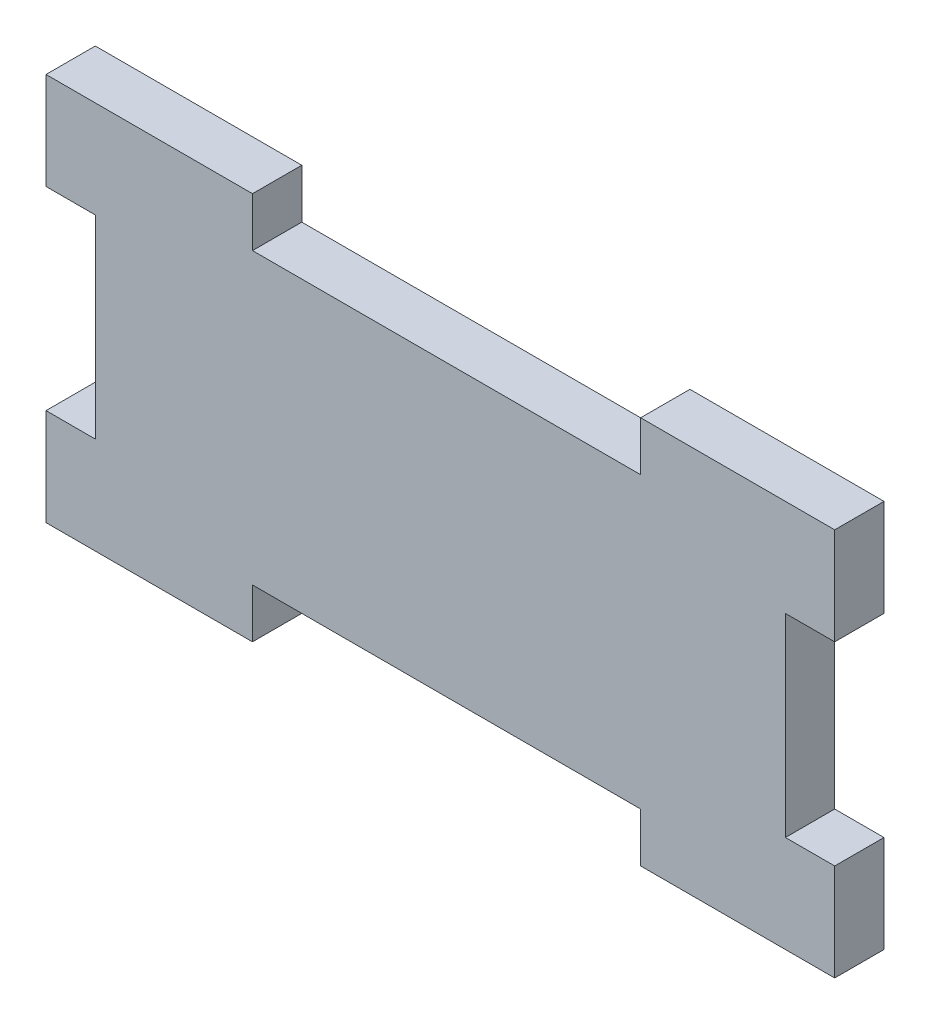
ISO-10303-21;
HEADER;
FILE_DESCRIPTION(('STEP AP214'),'2;1');
FILE_NAME('part.step','',(''),(''),'','','');
FILE_SCHEMA(('AUTOMOTIVE_DESIGN { 1 0 10303 214 1 1 1 1 }'));
ENDSEC;
DATA;
#1=APPLICATION_CONTEXT('core data for automotive mechanical design processes');
#2=APPLICATION_PROTOCOL_DEFINITION('international standard','automotive_design',2000,#1);
#3=PRODUCT_CONTEXT('',#1,'mechanical');
#4=PRODUCT('Part','Part','',(#3));
#5=PRODUCT_RELATED_PRODUCT_CATEGORY('part','',(#4));
#6=PRODUCT_DEFINITION_FORMATION('','',#4);
#7=PRODUCT_DEFINITION_CONTEXT('part definition',#1,'design');
#8=PRODUCT_DEFINITION('design','',#6,#7);
#9=PRODUCT_DEFINITION_SHAPE('','',#8);
#10=(LENGTH_UNIT() NAMED_UNIT(*) SI_UNIT(.MILLI.,.METRE.));
#11=(NAMED_UNIT(*) PLANE_ANGLE_UNIT() SI_UNIT($,.RADIAN.));
#12=(NAMED_UNIT(*) SI_UNIT($,.STERADIAN.) SOLID_ANGLE_UNIT());
#13=UNCERTAINTY_MEASURE_WITH_UNIT(LENGTH_MEASURE(1.E-05),#10,'distance_accuracy_value','');
#14=(GEOMETRIC_REPRESENTATION_CONTEXT(3) GLOBAL_UNCERTAINTY_ASSIGNED_CONTEXT((#13)) GLOBAL_UNIT_ASSIGNED_CONTEXT((#10,
#11,#12)) REPRESENTATION_CONTEXT('',''));
#15=CARTESIAN_POINT('',(0.,0.,0.));
#16=DIRECTION('',(0.,0.,1.));
#17=DIRECTION('',(1.,0.,0.));
#18=AXIS2_PLACEMENT_3D('',#15,#16,#17);
#19=CARTESIAN_POINT('',(0.,0.,6.35));
#20=DIRECTION('',(0.,1.,0.));
#21=DIRECTION('',(0.,0.,1.));
#22=AXIS2_PLACEMENT_3D('',#19,#20,#21);
#23=PLANE('',#22);
#24=DIRECTION('',(1.,0.,0.));
#25=VECTOR('',#24,1.);
#26=CARTESIAN_POINT('',(0.,0.,0.));
#27=LINE('',#26,#25);
#28=CARTESIAN_POINT('',(0.,0.,0.));
#29=VERTEX_POINT('',#28);
#30=CARTESIAN_POINT('',(26.6,0.,0.));
#31=VERTEX_POINT('',#30);
#32=EDGE_CURVE('E205',#29,#31,#27,.T.);
#33=ORIENTED_EDGE('',*,*,#32,.T.);
#34=DIRECTION('',(0.,0.,1.));
#35=VECTOR('',#34,1.);
#36=CARTESIAN_POINT('',(26.6,0.,0.));
#37=LINE('',#36,#35);
#38=CARTESIAN_POINT('',(26.6,0.,6.35));
#39=VERTEX_POINT('',#38);
#40=EDGE_CURVE('E312',#31,#39,#37,.T.);
#41=ORIENTED_EDGE('',*,*,#40,.T.);
#42=DIRECTION('',(1.,0.,0.));
#43=VECTOR('',#42,1.);
#44=CARTESIAN_POINT('',(0.,0.,6.35));
#45=LINE('',#44,#43);
#46=CARTESIAN_POINT('',(0.,0.,6.35));
#47=VERTEX_POINT('',#46);
#48=EDGE_CURVE('E375',#47,#39,#45,.T.);
#49=ORIENTED_EDGE('',*,*,#48,.F.);
#50=DIRECTION('',(0.,0.,-1.));
#51=VECTOR('',#50,1.);
#52=CARTESIAN_POINT('',(0.,0.,6.35));
#53=LINE('',#52,#51);
#54=EDGE_CURVE('E11',#47,#29,#53,.T.);
#55=ORIENTED_EDGE('',*,*,#54,.T.);
#56=EDGE_LOOP('',(#33,#41,#49,#55));
#57=FACE_BOUND('',#56,.T.);
#58=ADVANCED_FACE('F39',(#57),#23,.F.);
#59=CARTESIAN_POINT('',(101.6,0.,6.35));
#60=DIRECTION('',(-1.,0.,0.));
#61=DIRECTION('',(0.,0.,1.));
#62=AXIS2_PLACEMENT_3D('',#59,#60,#61);
#63=PLANE('',#62);
#64=DIRECTION('',(0.,1.,0.));
#65=VECTOR('',#64,1.);
#66=CARTESIAN_POINT('',(101.6,0.,0.));
#67=LINE('',#66,#65);
#68=CARTESIAN_POINT('',(101.6,0.,0.));
#69=VERTEX_POINT('',#68);
#70=CARTESIAN_POINT('',(101.6,12.5,0.));
#71=VERTEX_POINT('',#70);
#72=EDGE_CURVE('E204',#69,#71,#67,.T.);
#73=ORIENTED_EDGE('',*,*,#72,.T.);
#74=DIRECTION('',(0.,0.,1.));
#75=VECTOR('',#74,1.);
#76=CARTESIAN_POINT('',(101.6,12.5,0.));
#77=LINE('',#76,#75);
#78=CARTESIAN_POINT('',(101.6,12.5,6.35));
#79=VERTEX_POINT('',#78);
#80=EDGE_CURVE('E257',#71,#79,#77,.T.);
#81=ORIENTED_EDGE('',*,*,#80,.T.);
#82=DIRECTION('',(0.,1.,0.));
#83=VECTOR('',#82,1.);
#84=CARTESIAN_POINT('',(101.6,0.,6.35));
#85=LINE('',#84,#83);
#86=CARTESIAN_POINT('',(101.6,0.,6.35));
#87=VERTEX_POINT('',#86);
#88=EDGE_CURVE('E235',#87,#79,#85,.T.);
#89=ORIENTED_EDGE('',*,*,#88,.F.);
#90=DIRECTION('',(0.,0.,-1.));
#91=VECTOR('',#90,1.);
#92=CARTESIAN_POINT('',(101.6,0.,6.35));
#93=LINE('',#92,#91);
#94=EDGE_CURVE('E48',#87,#69,#93,.T.);
#95=ORIENTED_EDGE('',*,*,#94,.T.);
#96=EDGE_LOOP('',(#73,#81,#89,#95));
#97=FACE_BOUND('',#96,.T.);
#98=ADVANCED_FACE('F232',(#97),#63,.F.);
#99=CARTESIAN_POINT('',(0.,50.,6.35));
#100=DIRECTION('',(0.,-1.,0.));
#101=DIRECTION('',(0.,0.,-1.));
#102=AXIS2_PLACEMENT_3D('',#99,#100,#101);
#103=PLANE('',#102);
#104=DIRECTION('',(-1.,0.,0.));
#105=VECTOR('',#104,1.);
#106=CARTESIAN_POINT('',(0.,50.,6.35));
#107=LINE('',#106,#105);
#108=CARTESIAN_POINT('',(26.6,50.,6.35));
#109=VERTEX_POINT('',#108);
#110=CARTESIAN_POINT('',(0.,50.,6.35));
#111=VERTEX_POINT('',#110);
#112=EDGE_CURVE('E381',#109,#111,#107,.T.);
#113=ORIENTED_EDGE('',*,*,#112,.F.);
#114=DIRECTION('',(0.,0.,1.));
#115=VECTOR('',#114,1.);
#116=CARTESIAN_POINT('',(26.6,50.,0.));
#117=LINE('',#116,#115);
#118=CARTESIAN_POINT('',(26.6,50.,0.));
#119=VERTEX_POINT('',#118);
#120=EDGE_CURVE('E251',#119,#109,#117,.T.);
#121=ORIENTED_EDGE('',*,*,#120,.F.);
#122=DIRECTION('',(-1.,0.,0.));
#123=VECTOR('',#122,1.);
#124=CARTESIAN_POINT('',(0.,50.,0.));
#125=LINE('',#124,#123);
#126=CARTESIAN_POINT('',(0.,50.,0.));
#127=VERTEX_POINT('',#126);
#128=EDGE_CURVE('E210',#119,#127,#125,.T.);
#129=ORIENTED_EDGE('',*,*,#128,.T.);
#130=DIRECTION('',(0.,0.,-1.));
#131=VECTOR('',#130,1.);
#132=CARTESIAN_POINT('',(0.,50.,6.35));
#133=LINE('',#132,#131);
#134=EDGE_CURVE('E219',#111,#127,#133,.T.);
#135=ORIENTED_EDGE('',*,*,#134,.F.);
#136=EDGE_LOOP('',(#113,#121,#129,#135));
#137=FACE_BOUND('',#136,.T.);
#138=ADVANCED_FACE('F414',(#137),#103,.F.);
#139=CARTESIAN_POINT('',(0.,0.,6.35));
#140=DIRECTION('',(1.,0.,0.));
#141=DIRECTION('',(0.,0.,-1.));
#142=AXIS2_PLACEMENT_3D('',#139,#140,#141);
#143=PLANE('',#142);
#144=DIRECTION('',(0.,-1.,0.));
#145=VECTOR('',#144,1.);
#146=CARTESIAN_POINT('',(0.,0.,0.));
#147=LINE('',#146,#145);
#148=CARTESIAN_POINT('',(0.,37.5,0.));
#149=VERTEX_POINT('',#148);
#150=EDGE_CURVE('E384',#127,#149,#147,.T.);
#151=ORIENTED_EDGE('',*,*,#150,.T.);
#152=DIRECTION('',(0.,0.,1.));
#153=VECTOR('',#152,1.);
#154=CARTESIAN_POINT('',(0.,37.5,0.));
#155=LINE('',#154,#153);
#156=CARTESIAN_POINT('',(0.,37.5,6.35));
#157=VERTEX_POINT('',#156);
#158=EDGE_CURVE('E357',#149,#157,#155,.T.);
#159=ORIENTED_EDGE('',*,*,#158,.T.);
#160=DIRECTION('',(0.,-1.,0.));
#161=VECTOR('',#160,1.);
#162=CARTESIAN_POINT('',(0.,0.,6.35));
#163=LINE('',#162,#161);
#164=EDGE_CURVE('E370',#111,#157,#163,.T.);
#165=ORIENTED_EDGE('',*,*,#164,.F.);
#166=ORIENTED_EDGE('',*,*,#134,.T.);
#167=EDGE_LOOP('',(#151,#159,#165,#166));
#168=FACE_BOUND('',#167,.T.);
#169=ADVANCED_FACE('F416',(#168),#143,.F.);
#170=CARTESIAN_POINT('',(0.,12.5,6.35));
#171=VERTEX_POINT('',#170);
#172=EDGE_CURVE('E218',#171,#47,#163,.T.);
#173=ORIENTED_EDGE('',*,*,#172,.F.);
#174=DIRECTION('',(0.,0.,1.));
#175=VECTOR('',#174,1.);
#176=CARTESIAN_POINT('',(0.,12.5,0.));
#177=LINE('',#176,#175);
#178=CARTESIAN_POINT('',(0.,12.5,0.));
#179=VERTEX_POINT('',#178);
#180=EDGE_CURVE('E347',#179,#171,#177,.T.);
#181=ORIENTED_EDGE('',*,*,#180,.F.);
#182=EDGE_CURVE('E361',#179,#29,#147,.T.);
#183=ORIENTED_EDGE('',*,*,#182,.T.);
#184=ORIENTED_EDGE('',*,*,#54,.F.);
#185=EDGE_LOOP('',(#173,#181,#183,#184));
#186=FACE_BOUND('',#185,.T.);
#187=ADVANCED_FACE('F41',(#186),#143,.F.);
#188=CARTESIAN_POINT('',(76.6,0.,6.35));
#189=VERTEX_POINT('',#188);
#190=EDGE_CURVE('E374',#189,#87,#45,.T.);
#191=ORIENTED_EDGE('',*,*,#190,.F.);
#192=DIRECTION('',(0.,0.,1.));
#193=VECTOR('',#192,1.);
#194=CARTESIAN_POINT('',(76.6,0.,0.));
#195=LINE('',#194,#193);
#196=CARTESIAN_POINT('',(76.6,0.,0.));
#197=VERTEX_POINT('',#196);
#198=EDGE_CURVE('E328',#197,#189,#195,.T.);
#199=ORIENTED_EDGE('',*,*,#198,.F.);
#200=EDGE_CURVE('E212',#197,#69,#27,.T.);
#201=ORIENTED_EDGE('',*,*,#200,.T.);
#202=ORIENTED_EDGE('',*,*,#94,.F.);
#203=EDGE_LOOP('',(#191,#199,#201,#202));
#204=FACE_BOUND('',#203,.T.);
#205=ADVANCED_FACE('F428',(#204),#23,.F.);
#206=CARTESIAN_POINT('',(101.6,37.5,6.35));
#207=VERTEX_POINT('',#206);
#208=CARTESIAN_POINT('',(101.6,50.,6.35));
#209=VERTEX_POINT('',#208);
#210=EDGE_CURVE('E194',#207,#209,#85,.T.);
#211=ORIENTED_EDGE('',*,*,#210,.F.);
#212=DIRECTION('',(0.,0.,1.));
#213=VECTOR('',#212,1.);
#214=CARTESIAN_POINT('',(101.6,37.5,0.));
#215=LINE('',#214,#213);
#216=CARTESIAN_POINT('',(101.6,37.5,0.));
#217=VERTEX_POINT('',#216);
#218=EDGE_CURVE('E180',#217,#207,#215,.T.);
#219=ORIENTED_EDGE('',*,*,#218,.F.);
#220=CARTESIAN_POINT('',(101.6,50.,0.));
#221=VERTEX_POINT('',#220);
#222=EDGE_CURVE('E192',#217,#221,#67,.T.);
#223=ORIENTED_EDGE('',*,*,#222,.T.);
#224=DIRECTION('',(0.,0.,-1.));
#225=VECTOR('',#224,1.);
#226=CARTESIAN_POINT('',(101.6,50.,6.35));
#227=LINE('',#226,#225);
#228=EDGE_CURVE('E223',#209,#221,#227,.T.);
#229=ORIENTED_EDGE('',*,*,#228,.F.);
#230=EDGE_LOOP('',(#211,#219,#223,#229));
#231=FACE_BOUND('',#230,.T.);
#232=ADVANCED_FACE('F190',(#231),#63,.F.);
#233=CARTESIAN_POINT('',(76.6,50.,0.));
#234=VERTEX_POINT('',#233);
#235=EDGE_CURVE('E202',#221,#234,#125,.T.);
#236=ORIENTED_EDGE('',*,*,#235,.T.);
#237=DIRECTION('',(0.,0.,1.));
#238=VECTOR('',#237,1.);
#239=CARTESIAN_POINT('',(76.6,50.,0.));
#240=LINE('',#239,#238);
#241=CARTESIAN_POINT('',(76.6,50.,6.35));
#242=VERTEX_POINT('',#241);
#243=EDGE_CURVE('E291',#234,#242,#240,.T.);
#244=ORIENTED_EDGE('',*,*,#243,.T.);
#245=EDGE_CURVE('E224',#209,#242,#107,.T.);
#246=ORIENTED_EDGE('',*,*,#245,.F.);
#247=ORIENTED_EDGE('',*,*,#228,.T.);
#248=EDGE_LOOP('',(#236,#244,#246,#247));
#249=FACE_BOUND('',#248,.T.);
#250=ADVANCED_FACE('F459',(#249),#103,.F.);
#251=CARTESIAN_POINT('',(0.,0.,6.35));
#252=DIRECTION('',(0.,0.,-1.));
#253=DIRECTION('',(-1.,0.,0.));
#254=AXIS2_PLACEMENT_3D('',#251,#252,#253);
#255=PLANE('',#254);
#256=ORIENTED_EDGE('',*,*,#88,.T.);
#257=DIRECTION('',(1.,0.,0.));
#258=VECTOR('',#257,1.);
#259=CARTESIAN_POINT('',(101.6,12.5,6.35));
#260=LINE('',#259,#258);
#261=CARTESIAN_POINT('',(95.25,12.5,6.35));
#262=VERTEX_POINT('',#261);
#263=EDGE_CURVE('E186',#262,#79,#260,.T.);
#264=ORIENTED_EDGE('',*,*,#263,.F.);
#265=DIRECTION('',(0.,-1.,0.));
#266=VECTOR('',#265,1.);
#267=CARTESIAN_POINT('',(95.25,37.5,6.35));
#268=LINE('',#267,#266);
#269=CARTESIAN_POINT('',(95.25,37.5,6.35));
#270=VERTEX_POINT('',#269);
#271=EDGE_CURVE('E250',#270,#262,#268,.T.);
#272=ORIENTED_EDGE('',*,*,#271,.F.);
#273=DIRECTION('',(-1.,0.,0.));
#274=VECTOR('',#273,1.);
#275=CARTESIAN_POINT('',(101.6,37.5,6.35));
#276=LINE('',#275,#274);
#277=EDGE_CURVE('E247',#207,#270,#276,.T.);
#278=ORIENTED_EDGE('',*,*,#277,.F.);
#279=ORIENTED_EDGE('',*,*,#210,.T.);
#280=ORIENTED_EDGE('',*,*,#245,.T.);
#281=DIRECTION('',(0.,1.,0.));
#282=VECTOR('',#281,1.);
#283=CARTESIAN_POINT('',(76.6,50.,6.35));
#284=LINE('',#283,#282);
#285=CARTESIAN_POINT('',(76.6,43.65,6.35));
#286=VERTEX_POINT('',#285);
#287=EDGE_CURVE('E271',#286,#242,#284,.T.);
#288=ORIENTED_EDGE('',*,*,#287,.F.);
#289=DIRECTION('',(1.,0.,0.));
#290=VECTOR('',#289,1.);
#291=CARTESIAN_POINT('',(26.6,43.65,6.35));
#292=LINE('',#291,#290);
#293=CARTESIAN_POINT('',(26.6,43.65,6.35));
#294=VERTEX_POINT('',#293);
#295=EDGE_CURVE('E282',#294,#286,#292,.T.);
#296=ORIENTED_EDGE('',*,*,#295,.F.);
#297=DIRECTION('',(0.,-1.,0.));
#298=VECTOR('',#297,1.);
#299=CARTESIAN_POINT('',(26.6,50.,6.35));
#300=LINE('',#299,#298);
#301=EDGE_CURVE('E278',#109,#294,#300,.T.);
#302=ORIENTED_EDGE('',*,*,#301,.F.);
#303=ORIENTED_EDGE('',*,*,#112,.T.);
#304=ORIENTED_EDGE('',*,*,#164,.T.);
#305=DIRECTION('',(-1.,0.,0.));
#306=VECTOR('',#305,1.);
#307=CARTESIAN_POINT('',(0.,37.5,6.35));
#308=LINE('',#307,#306);
#309=CARTESIAN_POINT('',(6.35,37.5,6.35));
#310=VERTEX_POINT('',#309);
#311=EDGE_CURVE('E339',#310,#157,#308,.T.);
#312=ORIENTED_EDGE('',*,*,#311,.F.);
#313=DIRECTION('',(0.,1.,0.));
#314=VECTOR('',#313,1.);
#315=CARTESIAN_POINT('',(6.35,37.5,6.35));
#316=LINE('',#315,#314);
#317=CARTESIAN_POINT('',(6.35,12.5,6.35));
#318=VERTEX_POINT('',#317);
#319=EDGE_CURVE('E351',#318,#310,#316,.T.);
#320=ORIENTED_EDGE('',*,*,#319,.F.);
#321=DIRECTION('',(1.,0.,0.));
#322=VECTOR('',#321,1.);
#323=CARTESIAN_POINT('',(0.,12.5,6.35));
#324=LINE('',#323,#322);
#325=EDGE_CURVE('E260',#171,#318,#324,.T.);
#326=ORIENTED_EDGE('',*,*,#325,.F.);
#327=ORIENTED_EDGE('',*,*,#172,.T.);
#328=ORIENTED_EDGE('',*,*,#48,.T.);
#329=DIRECTION('',(0.,-1.,0.));
#330=VECTOR('',#329,1.);
#331=CARTESIAN_POINT('',(26.6,0.,6.35));
#332=LINE('',#331,#330);
#333=CARTESIAN_POINT('',(26.6,6.35,6.35));
#334=VERTEX_POINT('',#333);
#335=EDGE_CURVE('E313',#334,#39,#332,.T.);
#336=ORIENTED_EDGE('',*,*,#335,.F.);
#337=DIRECTION('',(-1.,0.,0.));
#338=VECTOR('',#337,1.);
#339=CARTESIAN_POINT('',(26.6,6.35,6.35));
#340=LINE('',#339,#338);
#341=CARTESIAN_POINT('',(76.6,6.35,6.35));
#342=VERTEX_POINT('',#341);
#343=EDGE_CURVE('E305',#342,#334,#340,.T.);
#344=ORIENTED_EDGE('',*,*,#343,.F.);
#345=DIRECTION('',(0.,1.,0.));
#346=VECTOR('',#345,1.);
#347=CARTESIAN_POINT('',(76.6,0.,6.35));
#348=LINE('',#347,#346);
#349=EDGE_CURVE('E316',#189,#342,#348,.T.);
#350=ORIENTED_EDGE('',*,*,#349,.F.);
#351=ORIENTED_EDGE('',*,*,#190,.T.);
#352=EDGE_LOOP('',(#256,#264,#272,#278,#279,#280,#288,#296,#302,#303,#304,#312,#320,#326,#327,
#328,#336,#344,#350,#351));
#353=FACE_BOUND('',#352,.T.);
#354=ADVANCED_FACE('F402',(#353),#255,.F.);
#355=CARTESIAN_POINT('',(0.,0.,0.));
#356=DIRECTION('',(0.,0.,-1.));
#357=DIRECTION('',(-1.,0.,0.));
#358=AXIS2_PLACEMENT_3D('',#355,#356,#357);
#359=PLANE('',#358);
#360=DIRECTION('',(1.,0.,0.));
#361=VECTOR('',#360,1.);
#362=CARTESIAN_POINT('',(101.6,12.5,0.));
#363=LINE('',#362,#361);
#364=CARTESIAN_POINT('',(95.25,12.5,0.));
#365=VERTEX_POINT('',#364);
#366=EDGE_CURVE('E196',#365,#71,#363,.T.);
#367=ORIENTED_EDGE('',*,*,#366,.T.);
#368=ORIENTED_EDGE('',*,*,#72,.F.);
#369=ORIENTED_EDGE('',*,*,#200,.F.);
#370=DIRECTION('',(0.,1.,0.));
#371=VECTOR('',#370,1.);
#372=CARTESIAN_POINT('',(76.6,0.,0.));
#373=LINE('',#372,#371);
#374=CARTESIAN_POINT('',(76.6,6.35,0.));
#375=VERTEX_POINT('',#374);
#376=EDGE_CURVE('E304',#197,#375,#373,.T.);
#377=ORIENTED_EDGE('',*,*,#376,.T.);
#378=DIRECTION('',(-1.,0.,0.));
#379=VECTOR('',#378,1.);
#380=CARTESIAN_POINT('',(26.6,6.35,0.));
#381=LINE('',#380,#379);
#382=CARTESIAN_POINT('',(26.6,6.35,0.));
#383=VERTEX_POINT('',#382);
#384=EDGE_CURVE('E308',#375,#383,#381,.T.);
#385=ORIENTED_EDGE('',*,*,#384,.T.);
#386=DIRECTION('',(0.,-1.,0.));
#387=VECTOR('',#386,1.);
#388=CARTESIAN_POINT('',(26.6,0.,0.));
#389=LINE('',#388,#387);
#390=EDGE_CURVE('E300',#383,#31,#389,.T.);
#391=ORIENTED_EDGE('',*,*,#390,.T.);
#392=ORIENTED_EDGE('',*,*,#32,.F.);
#393=ORIENTED_EDGE('',*,*,#182,.F.);
#394=DIRECTION('',(1.,0.,0.));
#395=VECTOR('',#394,1.);
#396=CARTESIAN_POINT('',(0.,12.5,0.));
#397=LINE('',#396,#395);
#398=CARTESIAN_POINT('',(6.35,12.5,0.));
#399=VERTEX_POINT('',#398);
#400=EDGE_CURVE('E334',#179,#399,#397,.T.);
#401=ORIENTED_EDGE('',*,*,#400,.T.);
#402=DIRECTION('',(0.,1.,0.));
#403=VECTOR('',#402,1.);
#404=CARTESIAN_POINT('',(6.35,37.5,0.));
#405=LINE('',#404,#403);
#406=CARTESIAN_POINT('',(6.35,37.5,0.));
#407=VERTEX_POINT('',#406);
#408=EDGE_CURVE('E338',#399,#407,#405,.T.);
#409=ORIENTED_EDGE('',*,*,#408,.T.);
#410=DIRECTION('',(-1.,0.,0.));
#411=VECTOR('',#410,1.);
#412=CARTESIAN_POINT('',(0.,37.5,0.));
#413=LINE('',#412,#411);
#414=EDGE_CURVE('E343',#407,#149,#413,.T.);
#415=ORIENTED_EDGE('',*,*,#414,.T.);
#416=ORIENTED_EDGE('',*,*,#150,.F.);
#417=ORIENTED_EDGE('',*,*,#128,.F.);
#418=DIRECTION('',(0.,-1.,0.));
#419=VECTOR('',#418,1.);
#420=CARTESIAN_POINT('',(26.6,50.,0.));
#421=LINE('',#420,#419);
#422=CARTESIAN_POINT('',(26.6,43.65,0.));
#423=VERTEX_POINT('',#422);
#424=EDGE_CURVE('E266',#119,#423,#421,.T.);
#425=ORIENTED_EDGE('',*,*,#424,.T.);
#426=DIRECTION('',(1.,0.,0.));
#427=VECTOR('',#426,1.);
#428=CARTESIAN_POINT('',(26.6,43.65,0.));
#429=LINE('',#428,#427);
#430=CARTESIAN_POINT('',(76.6,43.65,0.));
#431=VERTEX_POINT('',#430);
#432=EDGE_CURVE('E270',#423,#431,#429,.T.);
#433=ORIENTED_EDGE('',*,*,#432,.T.);
#434=DIRECTION('',(0.,1.,0.));
#435=VECTOR('',#434,1.);
#436=CARTESIAN_POINT('',(76.6,50.,0.));
#437=LINE('',#436,#435);
#438=EDGE_CURVE('E63',#431,#234,#437,.T.);
#439=ORIENTED_EDGE('',*,*,#438,.T.);
#440=ORIENTED_EDGE('',*,*,#235,.F.);
#441=ORIENTED_EDGE('',*,*,#222,.F.);
#442=DIRECTION('',(-1.,0.,0.));
#443=VECTOR('',#442,1.);
#444=CARTESIAN_POINT('',(101.6,37.5,0.));
#445=LINE('',#444,#443);
#446=CARTESIAN_POINT('',(95.25,37.5,0.));
#447=VERTEX_POINT('',#446);
#448=EDGE_CURVE('E176',#217,#447,#445,.T.);
#449=ORIENTED_EDGE('',*,*,#448,.T.);
#450=DIRECTION('',(0.,-1.,0.));
#451=VECTOR('',#450,1.);
#452=CARTESIAN_POINT('',(95.25,37.5,0.));
#453=LINE('',#452,#451);
#454=EDGE_CURVE('E55',#447,#365,#453,.T.);
#455=ORIENTED_EDGE('',*,*,#454,.T.);
#456=EDGE_LOOP('',(#367,#368,#369,#377,#385,#391,#392,#393,#401,#409,#415,#416,#417,#425,#433,
#439,#440,#441,#449,#455));
#457=FACE_BOUND('',#456,.T.);
#458=ADVANCED_FACE('F200',(#457),#359,.T.);
#459=CARTESIAN_POINT('',(0.,37.5,0.));
#460=DIRECTION('',(0.,1.,0.));
#461=DIRECTION('',(0.,0.,1.));
#462=AXIS2_PLACEMENT_3D('',#459,#460,#461);
#463=PLANE('',#462);
#464=ORIENTED_EDGE('',*,*,#311,.T.);
#465=ORIENTED_EDGE('',*,*,#158,.F.);
#466=ORIENTED_EDGE('',*,*,#414,.F.);
#467=DIRECTION('',(0.,0.,1.));
#468=VECTOR('',#467,1.);
#469=CARTESIAN_POINT('',(6.35,37.5,0.));
#470=LINE('',#469,#468);
#471=EDGE_CURVE('E362',#407,#310,#470,.T.);
#472=ORIENTED_EDGE('',*,*,#471,.T.);
#473=EDGE_LOOP('',(#464,#465,#466,#472));
#474=FACE_BOUND('',#473,.T.);
#475=ADVANCED_FACE('F419',(#474),#463,.F.);
#476=CARTESIAN_POINT('',(6.35,37.5,0.));
#477=DIRECTION('',(1.,0.,0.));
#478=DIRECTION('',(0.,1.,0.));
#479=AXIS2_PLACEMENT_3D('',#476,#477,#478);
#480=PLANE('',#479);
#481=ORIENTED_EDGE('',*,*,#319,.T.);
#482=ORIENTED_EDGE('',*,*,#471,.F.);
#483=ORIENTED_EDGE('',*,*,#408,.F.);
#484=DIRECTION('',(0.,0.,1.));
#485=VECTOR('',#484,1.);
#486=CARTESIAN_POINT('',(6.35,12.5,0.));
#487=LINE('',#486,#485);
#488=EDGE_CURVE('E365',#399,#318,#487,.T.);
#489=ORIENTED_EDGE('',*,*,#488,.T.);
#490=EDGE_LOOP('',(#481,#482,#483,#489));
#491=FACE_BOUND('',#490,.T.);
#492=ADVANCED_FACE('F444',(#491),#480,.F.);
#493=CARTESIAN_POINT('',(0.,12.5,0.));
#494=DIRECTION('',(0.,-1.,0.));
#495=DIRECTION('',(0.,0.,-1.));
#496=AXIS2_PLACEMENT_3D('',#493,#494,#495);
#497=PLANE('',#496);
#498=ORIENTED_EDGE('',*,*,#325,.T.);
#499=ORIENTED_EDGE('',*,*,#488,.F.);
#500=ORIENTED_EDGE('',*,*,#400,.F.);
#501=ORIENTED_EDGE('',*,*,#180,.T.);
#502=EDGE_LOOP('',(#498,#499,#500,#501));
#503=FACE_BOUND('',#502,.T.);
#504=ADVANCED_FACE('F437',(#503),#497,.F.);
#505=CARTESIAN_POINT('',(26.6,0.,0.));
#506=DIRECTION('',(-1.,0.,0.));
#507=DIRECTION('',(0.,0.,1.));
#508=AXIS2_PLACEMENT_3D('',#505,#506,#507);
#509=PLANE('',#508);
#510=ORIENTED_EDGE('',*,*,#335,.T.);
#511=ORIENTED_EDGE('',*,*,#40,.F.);
#512=ORIENTED_EDGE('',*,*,#390,.F.);
#513=DIRECTION('',(0.,0.,1.));
#514=VECTOR('',#513,1.);
#515=CARTESIAN_POINT('',(26.6,6.35,0.));
#516=LINE('',#515,#514);
#517=EDGE_CURVE('E283',#383,#334,#516,.T.);
#518=ORIENTED_EDGE('',*,*,#517,.T.);
#519=EDGE_LOOP('',(#510,#511,#512,#518));
#520=FACE_BOUND('',#519,.T.);
#521=ADVANCED_FACE('F435',(#520),#509,.F.);
#522=CARTESIAN_POINT('',(26.6,6.35,0.));
#523=DIRECTION('',(0.,1.,0.));
#524=DIRECTION('',(0.,0.,1.));
#525=AXIS2_PLACEMENT_3D('',#522,#523,#524);
#526=PLANE('',#525);
#527=ORIENTED_EDGE('',*,*,#343,.T.);
#528=ORIENTED_EDGE('',*,*,#517,.F.);
#529=ORIENTED_EDGE('',*,*,#384,.F.);
#530=DIRECTION('',(0.,0.,1.));
#531=VECTOR('',#530,1.);
#532=CARTESIAN_POINT('',(76.6,6.35,0.));
#533=LINE('',#532,#531);
#534=EDGE_CURVE('E325',#375,#342,#533,.T.);
#535=ORIENTED_EDGE('',*,*,#534,.T.);
#536=EDGE_LOOP('',(#527,#528,#529,#535));
#537=FACE_BOUND('',#536,.T.);
#538=ADVANCED_FACE('F433',(#537),#526,.F.);
#539=CARTESIAN_POINT('',(76.6,0.,0.));
#540=DIRECTION('',(1.,0.,0.));
#541=DIRECTION('',(0.,0.,-1.));
#542=AXIS2_PLACEMENT_3D('',#539,#540,#541);
#543=PLANE('',#542);
#544=ORIENTED_EDGE('',*,*,#349,.T.);
#545=ORIENTED_EDGE('',*,*,#534,.F.);
#546=ORIENTED_EDGE('',*,*,#376,.F.);
#547=ORIENTED_EDGE('',*,*,#198,.T.);
#548=EDGE_LOOP('',(#544,#545,#546,#547));
#549=FACE_BOUND('',#548,.T.);
#550=ADVANCED_FACE('F430',(#549),#543,.F.);
#551=CARTESIAN_POINT('',(26.6,50.,0.));
#552=DIRECTION('',(-1.,0.,0.));
#553=DIRECTION('',(0.,-1.,0.));
#554=AXIS2_PLACEMENT_3D('',#551,#552,#553);
#555=PLANE('',#554);
#556=ORIENTED_EDGE('',*,*,#301,.T.);
#557=DIRECTION('',(0.,0.,1.));
#558=VECTOR('',#557,1.);
#559=CARTESIAN_POINT('',(26.6,43.65,0.));
#560=LINE('',#559,#558);
#561=EDGE_CURVE('E277',#423,#294,#560,.T.);
#562=ORIENTED_EDGE('',*,*,#561,.F.);
#563=ORIENTED_EDGE('',*,*,#424,.F.);
#564=ORIENTED_EDGE('',*,*,#120,.T.);
#565=EDGE_LOOP('',(#556,#562,#563,#564));
#566=FACE_BOUND('',#565,.T.);
#567=ADVANCED_FACE('F496',(#566),#555,.F.);
#568=CARTESIAN_POINT('',(76.6,50.,0.));
#569=DIRECTION('',(1.,0.,0.));
#570=DIRECTION('',(0.,0.,-1.));
#571=AXIS2_PLACEMENT_3D('',#568,#569,#570);
#572=PLANE('',#571);
#573=ORIENTED_EDGE('',*,*,#287,.T.);
#574=ORIENTED_EDGE('',*,*,#243,.F.);
#575=ORIENTED_EDGE('',*,*,#438,.F.);
#576=DIRECTION('',(0.,0.,1.));
#577=VECTOR('',#576,1.);
#578=CARTESIAN_POINT('',(76.6,43.65,0.));
#579=LINE('',#578,#577);
#580=EDGE_CURVE('E295',#431,#286,#579,.T.);
#581=ORIENTED_EDGE('',*,*,#580,.T.);
#582=EDGE_LOOP('',(#573,#574,#575,#581));
#583=FACE_BOUND('',#582,.T.);
#584=ADVANCED_FACE('F489',(#583),#572,.F.);
#585=CARTESIAN_POINT('',(26.6,43.65,0.));
#586=DIRECTION('',(0.,-1.,0.));
#587=DIRECTION('',(0.,0.,-1.));
#588=AXIS2_PLACEMENT_3D('',#585,#586,#587);
#589=PLANE('',#588);
#590=ORIENTED_EDGE('',*,*,#295,.T.);
#591=ORIENTED_EDGE('',*,*,#580,.F.);
#592=ORIENTED_EDGE('',*,*,#432,.F.);
#593=ORIENTED_EDGE('',*,*,#561,.T.);
#594=EDGE_LOOP('',(#590,#591,#592,#593));
#595=FACE_BOUND('',#594,.T.);
#596=ADVANCED_FACE('F482',(#595),#589,.F.);
#597=CARTESIAN_POINT('',(101.6,12.5,0.));
#598=DIRECTION('',(0.,-1.,0.));
#599=DIRECTION('',(0.,0.,-1.));
#600=AXIS2_PLACEMENT_3D('',#597,#598,#599);
#601=PLANE('',#600);
#602=ORIENTED_EDGE('',*,*,#263,.T.);
#603=ORIENTED_EDGE('',*,*,#80,.F.);
#604=ORIENTED_EDGE('',*,*,#366,.F.);
#605=DIRECTION('',(0.,0.,1.));
#606=VECTOR('',#605,1.);
#607=CARTESIAN_POINT('',(95.25,12.5,0.));
#608=LINE('',#607,#606);
#609=EDGE_CURVE('E261',#365,#262,#608,.T.);
#610=ORIENTED_EDGE('',*,*,#609,.T.);
#611=EDGE_LOOP('',(#602,#603,#604,#610));
#612=FACE_BOUND('',#611,.T.);
#613=ADVANCED_FACE('F480',(#612),#601,.F.);
#614=CARTESIAN_POINT('',(95.25,37.5,0.));
#615=DIRECTION('',(-1.,0.,0.));
#616=DIRECTION('',(0.,0.,1.));
#617=AXIS2_PLACEMENT_3D('',#614,#615,#616);
#618=PLANE('',#617);
#619=ORIENTED_EDGE('',*,*,#271,.T.);
#620=ORIENTED_EDGE('',*,*,#609,.F.);
#621=ORIENTED_EDGE('',*,*,#454,.F.);
#622=DIRECTION('',(0.,0.,1.));
#623=VECTOR('',#622,1.);
#624=CARTESIAN_POINT('',(95.25,37.5,0.));
#625=LINE('',#624,#623);
#626=EDGE_CURVE('E182',#447,#270,#625,.T.);
#627=ORIENTED_EDGE('',*,*,#626,.T.);
#628=EDGE_LOOP('',(#619,#620,#621,#627));
#629=FACE_BOUND('',#628,.T.);
#630=ADVANCED_FACE('F479',(#629),#618,.F.);
#631=CARTESIAN_POINT('',(101.6,37.5,0.));
#632=DIRECTION('',(0.,1.,0.));
#633=DIRECTION('',(0.,0.,1.));
#634=AXIS2_PLACEMENT_3D('',#631,#632,#633);
#635=PLANE('',#634);
#636=ORIENTED_EDGE('',*,*,#277,.T.);
#637=ORIENTED_EDGE('',*,*,#626,.F.);
#638=ORIENTED_EDGE('',*,*,#448,.F.);
#639=ORIENTED_EDGE('',*,*,#218,.T.);
#640=EDGE_LOOP('',(#636,#637,#638,#639));
#641=FACE_BOUND('',#640,.T.);
#642=ADVANCED_FACE('F179',(#641),#635,.F.);
#643=CLOSED_SHELL('',(#58,#98,#138,#169,#187,#205,#232,#250,#354,#458,#475,#492,#504,#521,#538,
#550,#567,#584,#596,#613,#630,#642));
#644=MANIFOLD_SOLID_BREP('B2',#643);
#645=ADVANCED_BREP_SHAPE_REPRESENTATION('',(#18,#644),#14);
#646=SHAPE_DEFINITION_REPRESENTATION(#9,#645);
ENDSEC;
END-ISO-10303-21;
